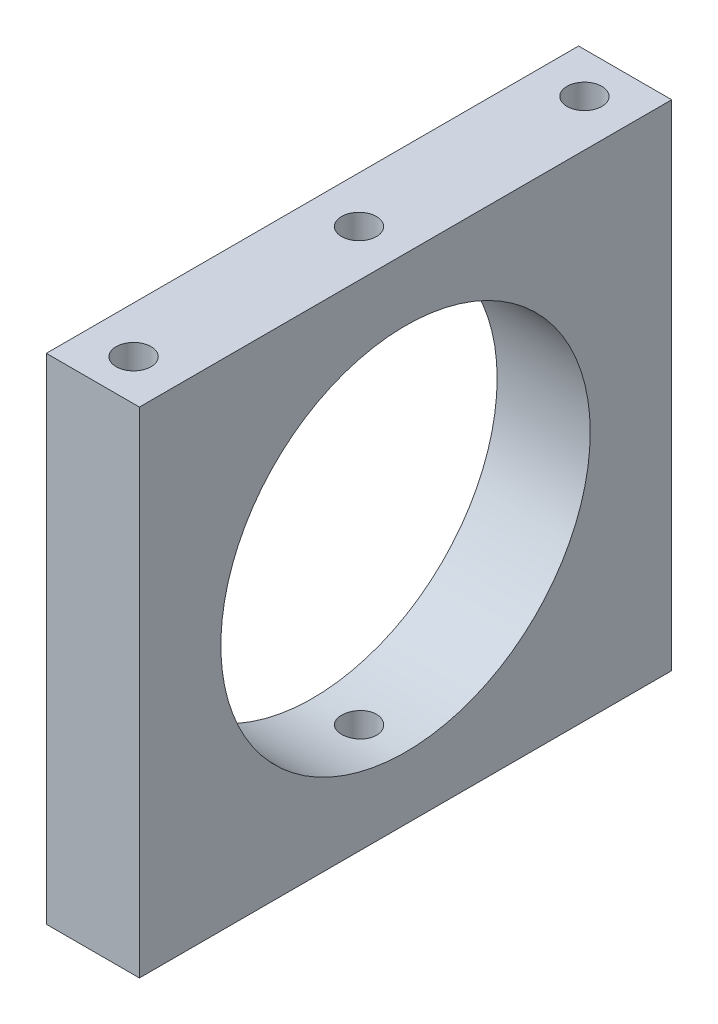
ISO-10303-21;
HEADER;
FILE_DESCRIPTION(('STEP AP214'),'2;1');
FILE_NAME('part.step','',(''),(''),'','','');
FILE_SCHEMA(('AUTOMOTIVE_DESIGN { 1 0 10303 214 1 1 1 1 }'));
ENDSEC;
DATA;
#1=APPLICATION_CONTEXT('core data for automotive mechanical design processes');
#2=APPLICATION_PROTOCOL_DEFINITION('international standard','automotive_design',2000,#1);
#3=PRODUCT_CONTEXT('',#1,'mechanical');
#4=PRODUCT('Part','Part','',(#3));
#5=PRODUCT_RELATED_PRODUCT_CATEGORY('part','',(#4));
#6=PRODUCT_DEFINITION_FORMATION('','',#4);
#7=PRODUCT_DEFINITION_CONTEXT('part definition',#1,'design');
#8=PRODUCT_DEFINITION('design','',#6,#7);
#9=PRODUCT_DEFINITION_SHAPE('','',#8);
#10=(LENGTH_UNIT() NAMED_UNIT(*) SI_UNIT(.MILLI.,.METRE.));
#11=(NAMED_UNIT(*) PLANE_ANGLE_UNIT() SI_UNIT($,.RADIAN.));
#12=(NAMED_UNIT(*) SI_UNIT($,.STERADIAN.) SOLID_ANGLE_UNIT());
#13=UNCERTAINTY_MEASURE_WITH_UNIT(LENGTH_MEASURE(1.E-05),#10,'distance_accuracy_value','');
#14=(GEOMETRIC_REPRESENTATION_CONTEXT(3) GLOBAL_UNCERTAINTY_ASSIGNED_CONTEXT((#13)) GLOBAL_UNIT_ASSIGNED_CONTEXT((#10,
#11,#12)) REPRESENTATION_CONTEXT('',''));
#15=CARTESIAN_POINT('',(0.,0.,0.));
#16=DIRECTION('',(0.,0.,1.));
#17=DIRECTION('',(1.,0.,0.));
#18=AXIS2_PLACEMENT_3D('',#15,#16,#17);
#19=CARTESIAN_POINT('',(0.,42.5,0.));
#20=DIRECTION('',(0.,-1.,0.));
#21=DIRECTION('',(0.,0.,-1.));
#22=AXIS2_PLACEMENT_3D('',#19,#20,#21);
#23=CYLINDRICAL_SURFACE('',#22,1.5);
#24=CARTESIAN_POINT('',(0.,37.0539749746701,-1.5));
#25=CARTESIAN_POINT('',(-0.0840536363328037,37.0539759091438,-1.49999634776618));
#26=CARTESIAN_POINT('',(-0.168163426862821,37.0546527591964,-1.49291120097191));
#27=CARTESIAN_POINT('',(-0.334052706700717,37.0572867743299,-1.46475324591116));
#28=CARTESIAN_POINT('',(-0.415829496781324,37.0592453642789,-1.44366487033248));
#29=CARTESIAN_POINT('',(-0.574626323247356,37.0642190684957,-1.38811853846567));
#30=CARTESIAN_POINT('',(-0.651649146485269,37.067233556725,-1.35366850296343));
#31=CARTESIAN_POINT('',(-0.798801947901103,37.0739786258328,-1.27239159203109));
#32=CARTESIAN_POINT('',(-0.868933327699084,37.0777090606404,-1.22556724053538));
#33=CARTESIAN_POINT('',(-1.00055842747435,37.0854793344331,-1.12070653593236));
#34=CARTESIAN_POINT('',(-1.06202653022181,37.0895200386241,-1.06263808817007));
#35=CARTESIAN_POINT('',(-1.17435979871408,37.097447689727,-0.93700592709332));
#36=CARTESIAN_POINT('',(-1.22522448709617,37.1013346297102,-0.869441786514596));
#37=CARTESIAN_POINT('',(-1.31499460002741,37.1085252402982,-0.726580460498479));
#38=CARTESIAN_POINT('',(-1.35387750641946,37.111827807755,-0.651269065022947));
#39=CARTESIAN_POINT('',(-1.41843626571398,37.1174681764433,-0.495149858781122));
#40=CARTESIAN_POINT('',(-1.44411240865282,37.1198059988614,-0.414342168764188));
#41=CARTESIAN_POINT('',(-1.48145407950935,37.1232474033305,-0.249781906954086));
#42=CARTESIAN_POINT('',(-1.49316149552488,37.1243546747531,-0.16603891869654));
#43=CARTESIAN_POINT('',(-1.50236294990409,37.1252227508324,0.00223019838057203));
#44=CARTESIAN_POINT('',(-1.49985732028504,37.1249835869419,0.0867563088603229));
#45=CARTESIAN_POINT('',(-1.48073790026304,37.1231887675992,0.253908044355716));
#46=CARTESIAN_POINT('',(-1.46416915264964,37.1216373153328,0.33653887295524));
#47=CARTESIAN_POINT('',(-1.41746394672628,37.11739715833,0.497841544232952));
#48=CARTESIAN_POINT('',(-1.38732732848963,37.1147084401883,0.576513340233232));
#49=CARTESIAN_POINT('',(-1.31429217669509,37.1084888760944,0.72780719825892));
#50=CARTESIAN_POINT('',(-1.27137362672072,37.1049567110424,0.800419541194211));
#51=CARTESIAN_POINT('',(-1.17400744487762,37.0974468033413,0.937427234183074));
#52=CARTESIAN_POINT('',(-1.11955951140564,37.093469049037,1.00182236920771));
#53=CARTESIAN_POINT('',(-1.00042662738608,37.0854962314334,1.12083136546873));
#54=CARTESIAN_POINT('',(-0.935702509043064,37.0815011612309,1.17540602526128));
#55=CARTESIAN_POINT('',(-0.797990578993203,37.0739595324643,1.27292162366473));
#56=CARTESIAN_POINT('',(-0.725002757303458,37.0704129744419,1.31586254822137));
#57=CARTESIAN_POINT('',(-0.572806062756796,37.0641694905722,1.3888910942952));
#58=CARTESIAN_POINT('',(-0.493596086531489,37.0614727158428,1.41897643002491));
#59=CARTESIAN_POINT('',(-0.331217833039493,37.0572372200977,1.46540946615925));
#60=CARTESIAN_POINT('',(-0.248049663258699,37.0556984676546,1.48175753937857));
#61=CARTESIAN_POINT('',(-0.0804596164003408,37.0539585730314,1.50020184306004));
#62=CARTESIAN_POINT('',(0.00395618051161047,37.0537522894256,1.50235285459515));
#63=CARTESIAN_POINT('',(0.171947065883922,37.0546871210395,1.49248571332648));
#64=CARTESIAN_POINT('',(0.255522164453875,37.0558282200371,1.48046773111406));
#65=CARTESIAN_POINT('',(0.419300430730805,37.0593245635284,1.44264952423754));
#66=CARTESIAN_POINT('',(0.499509604919228,37.061677536278,1.41687508377161));
#67=CARTESIAN_POINT('',(0.654465658964648,37.067330651119,1.35230188608052));
#68=CARTESIAN_POINT('',(0.72921242671256,37.0706308126434,1.31350286163338));
#69=CARTESIAN_POINT('',(0.871371922660361,37.077818915049,1.22384413984744));
#70=CARTESIAN_POINT('',(0.938761620636482,37.081708615485,1.17294806988556));
#71=CARTESIAN_POINT('',(1.06406076225195,37.0896317019391,1.06059228180143));
#72=CARTESIAN_POINT('',(1.12196999632234,37.0936650911311,0.999132330222436));
#73=CARTESIAN_POINT('',(1.2268526172345,37.1014365428754,0.867156072198296));
#74=CARTESIAN_POINT('',(1.27379031769242,37.1051736162774,0.796611339165302));
#75=CARTESIAN_POINT('',(1.35515216383036,37.1119170222681,0.648608861652388));
#76=CARTESIAN_POINT('',(1.38957646488746,37.1149233639299,0.57115120302415));
#77=CARTESIAN_POINT('',(1.44487357746314,37.1198620781876,0.411647340117423));
#78=CARTESIAN_POINT('',(1.46576812289318,37.1217961724963,0.329608726063212));
#79=CARTESIAN_POINT('',(1.49348357275269,37.1243795121223,0.163168507417491));
#80=CARTESIAN_POINT('',(1.50030482735093,37.1250287894083,0.0787669616729303));
#81=CARTESIAN_POINT('',(1.49967544175684,37.124969346211,-0.0896523179622793));
#82=CARTESIAN_POINT('',(1.49228027601232,37.1242659042229,-0.173670266555677));
#83=CARTESIAN_POINT('',(1.46354407268718,37.1215904802042,-0.339264836196759));
#84=CARTESIAN_POINT('',(1.44220302108887,37.1196184968984,-0.420841454790455));
#85=CARTESIAN_POINT('',(1.38619577956841,37.1146270396578,-0.579238654230514));
#86=CARTESIAN_POINT('',(1.35153100031499,37.1116076766191,-0.656059737576576));
#87=CARTESIAN_POINT('',(1.26986634095852,37.1048584573002,-0.802801454984796));
#88=CARTESIAN_POINT('',(1.22286657582933,37.1011286076424,-0.872722153356779));
#89=CARTESIAN_POINT('',(1.11765785168654,37.0933591562376,-1.00396255764163));
#90=CARTESIAN_POINT('',(1.05940764396942,37.0893184486117,-1.06524913148993));
#91=CARTESIAN_POINT('',(0.93343104545471,37.0813920904196,-1.17720353420051));
#92=CARTESIAN_POINT('',(0.865702376990453,37.0775064774119,-1.22786880344016));
#93=CARTESIAN_POINT('',(0.722523263489063,37.0703206308754,-1.31723224863173));
#94=CARTESIAN_POINT('',(0.647055382269658,37.0670217670734,-1.35590257564195));
#95=CARTESIAN_POINT('',(0.490715740360539,37.061399362306,-1.41997150275164));
#96=CARTESIAN_POINT('',(0.409850234627423,37.059074714375,-1.44538517398431));
#97=CARTESIAN_POINT('',(0.273766651124052,37.0562542769887,-1.4758344340282));
#98=CARTESIAN_POINT('',(0.219420484698648,37.0554035409091,-1.48488425599049));
#99=CARTESIAN_POINT('',(0.110057570231307,37.054263584812,-1.49696822381459));
#100=CARTESIAN_POINT('',(0.0550408246330296,37.0539743627489,-1.50000239159148));
#101=CARTESIAN_POINT('',(0.,37.0539749746701,-1.5));
#102=B_SPLINE_CURVE_WITH_KNOTS('',3,(#24,#25,#26,#27,#28,#29,#30,#31,#32,#33,#34,#35,#36,#37,
#38,#39,#40,#41,#42,#43,#44,#45,#46,#47,#48,#49,#50,#51,#52,#53,#54,#55,#56,#57,#58,#59,#60,#61,
#62,#63,#64,#65,#66,#67,#68,#69,#70,#71,#72,#73,#74,#75,#76,#77,#78,#79,#80,#81,#82,#83,#84,#85,
#86,#87,#88,#89,#90,#91,#92,#93,#94,#95,#96,#97,#98,#99,#100,#101),.UNSPECIFIED.,.T.,.F.,(4,2,2,
2,2,2,2,2,2,2,2,2,2,2,2,2,2,2,2,2,2,2,2,2,2,2,2,2,2,2,2,2,2,2,2,2,2,2,4),(0.,0.25195992212741,
0.50420041670237,0.756291611204931,1.0083314274155,1.26110155190283,1.5138830535734,
1.76713676698046,2.02038491839434,2.27287172910891,2.52535264174654,2.777027921131,
3.02870616713031,3.28078063067709,3.53286168918815,3.78592770285885,4.03899402224708,
4.29210531937791,4.54520974711535,4.79733696707451,5.04946115151211,5.30111442206551,
5.55277285603892,5.80519775211318,6.05762822737451,6.31086868325619,6.56410599457992,
6.81693549501914,7.06975870453033,7.32159736495547,7.57343627851654,7.82524853561388,
8.07705844566362,8.32980974749957,8.58262188989684,8.83601667322986,9.08912274756833,
9.25411421034408,9.41910507205359),.UNSPECIFIED.);
#103=CARTESIAN_POINT('',(0.,37.0539749746701,-1.5));
#104=VERTEX_POINT('',#103);
#105=EDGE_CURVE('E41',#104,#104,#102,.T.);
#106=ORIENTED_EDGE('',*,*,#105,.F.);
#107=EDGE_LOOP('',(#106));
#108=FACE_BOUND('',#107,.T.);
#109=CARTESIAN_POINT('',(0.,42.5,0.));
#110=DIRECTION('',(0.,1.,0.));
#111=DIRECTION('',(0.,0.,1.));
#112=AXIS2_PLACEMENT_3D('',#109,#110,#111);
#113=CIRCLE('',#112,1.5);
#114=CARTESIAN_POINT('',(0.,42.5,1.50000000000001));
#115=VERTEX_POINT('',#114);
#116=EDGE_CURVE('E113',#115,#115,#113,.T.);
#117=ORIENTED_EDGE('',*,*,#116,.T.);
#118=EDGE_LOOP('',(#117));
#119=FACE_BOUND('',#118,.T.);
#120=ADVANCED_FACE('F37',(#108,#119),#23,.F.);
#121=CARTESIAN_POINT('',(0.,42.5,0.));
#122=DIRECTION('',(0.,-1.,0.));
#123=DIRECTION('',(0.,0.,-1.));
#124=AXIS2_PLACEMENT_3D('',#121,#122,#123);
#125=PLANE('',#124);
#126=DIRECTION('',(0.,0.,-1.));
#127=VECTOR('',#126,1.);
#128=CARTESIAN_POINT('',(4.0005,42.5,22.875));
#129=LINE('',#128,#127);
#130=CARTESIAN_POINT('',(4.0005,42.5,22.875));
#131=VERTEX_POINT('',#130);
#132=CARTESIAN_POINT('',(4.0005,42.5,-22.875));
#133=VERTEX_POINT('',#132);
#134=EDGE_CURVE('E97',#131,#133,#129,.T.);
#135=ORIENTED_EDGE('',*,*,#134,.T.);
#136=DIRECTION('',(-1.,0.,0.));
#137=VECTOR('',#136,1.);
#138=CARTESIAN_POINT('',(-4.0005,42.5,-22.875));
#139=LINE('',#138,#137);
#140=CARTESIAN_POINT('',(-4.0005,42.5,-22.875));
#141=VERTEX_POINT('',#140);
#142=EDGE_CURVE('E91',#133,#141,#139,.T.);
#143=ORIENTED_EDGE('',*,*,#142,.T.);
#144=DIRECTION('',(0.,0.,1.));
#145=VECTOR('',#144,1.);
#146=CARTESIAN_POINT('',(-4.0005,42.5,22.875));
#147=LINE('',#146,#145);
#148=CARTESIAN_POINT('',(-4.0005,42.5,22.875));
#149=VERTEX_POINT('',#148);
#150=EDGE_CURVE('E95',#141,#149,#147,.T.);
#151=ORIENTED_EDGE('',*,*,#150,.T.);
#152=DIRECTION('',(1.,0.,0.));
#153=VECTOR('',#152,1.);
#154=CARTESIAN_POINT('',(-4.0005,42.5,22.875));
#155=LINE('',#154,#153);
#156=EDGE_CURVE('E61',#149,#131,#155,.T.);
#157=ORIENTED_EDGE('',*,*,#156,.T.);
#158=EDGE_LOOP('',(#135,#143,#151,#157));
#159=FACE_BOUND('',#158,.T.);
#160=ORIENTED_EDGE('',*,*,#116,.F.);
#161=EDGE_LOOP('',(#160));
#162=FACE_BOUND('',#161,.T.);
#163=CARTESIAN_POINT('',(0.,42.5,-19.375));
#164=DIRECTION('',(0.,1.,0.));
#165=DIRECTION('',(0.,0.,1.));
#166=AXIS2_PLACEMENT_3D('',#163,#164,#165);
#167=CIRCLE('',#166,1.5);
#168=CARTESIAN_POINT('',(0.,42.5,-17.875));
#169=VERTEX_POINT('',#168);
#170=EDGE_CURVE('E161',#169,#169,#167,.T.);
#171=ORIENTED_EDGE('',*,*,#170,.F.);
#172=EDGE_LOOP('',(#171));
#173=FACE_BOUND('',#172,.T.);
#174=CARTESIAN_POINT('',(0.,42.5,19.375));
#175=DIRECTION('',(0.,1.,0.));
#176=DIRECTION('',(0.,0.,1.));
#177=AXIS2_PLACEMENT_3D('',#174,#175,#176);
#178=CIRCLE('',#177,1.5);
#179=CARTESIAN_POINT('',(0.,42.5,20.875));
#180=VERTEX_POINT('',#179);
#181=EDGE_CURVE('E167',#180,#180,#178,.T.);
#182=ORIENTED_EDGE('',*,*,#181,.F.);
#183=EDGE_LOOP('',(#182));
#184=FACE_BOUND('',#183,.T.);
#185=ADVANCED_FACE('F92',(#159,#162,#173,#184),#125,.F.);
#186=CARTESIAN_POINT('',(0.,0.,0.));
#187=DIRECTION('',(0.,-1.,0.));
#188=DIRECTION('',(0.,0.,-1.));
#189=AXIS2_PLACEMENT_3D('',#186,#187,#188);
#190=PLANE('',#189);
#191=CARTESIAN_POINT('',(0.,0.,-19.375));
#192=DIRECTION('',(0.,1.,0.));
#193=DIRECTION('',(0.,0.,1.));
#194=AXIS2_PLACEMENT_3D('',#191,#192,#193);
#195=CIRCLE('',#194,1.5);
#196=CARTESIAN_POINT('',(0.,0.,-17.875));
#197=VERTEX_POINT('',#196);
#198=EDGE_CURVE('E164',#197,#197,#195,.T.);
#199=ORIENTED_EDGE('',*,*,#198,.T.);
#200=EDGE_LOOP('',(#199));
#201=FACE_BOUND('',#200,.T.);
#202=DIRECTION('',(0.,0.,-1.));
#203=VECTOR('',#202,1.);
#204=CARTESIAN_POINT('',(4.0005,0.,22.875));
#205=LINE('',#204,#203);
#206=CARTESIAN_POINT('',(4.0005,0.,22.875));
#207=VERTEX_POINT('',#206);
#208=CARTESIAN_POINT('',(4.0005,0.,-22.875));
#209=VERTEX_POINT('',#208);
#210=EDGE_CURVE('E110',#207,#209,#205,.T.);
#211=ORIENTED_EDGE('',*,*,#210,.F.);
#212=DIRECTION('',(1.,0.,0.));
#213=VECTOR('',#212,1.);
#214=CARTESIAN_POINT('',(-4.0005,0.,22.875));
#215=LINE('',#214,#213);
#216=CARTESIAN_POINT('',(-4.0005,0.,22.875));
#217=VERTEX_POINT('',#216);
#218=EDGE_CURVE('E84',#217,#207,#215,.T.);
#219=ORIENTED_EDGE('',*,*,#218,.F.);
#220=DIRECTION('',(0.,0.,1.));
#221=VECTOR('',#220,1.);
#222=CARTESIAN_POINT('',(-4.0005,0.,22.875));
#223=LINE('',#222,#221);
#224=CARTESIAN_POINT('',(-4.0005,0.,-22.875));
#225=VERTEX_POINT('',#224);
#226=EDGE_CURVE('E78',#225,#217,#223,.T.);
#227=ORIENTED_EDGE('',*,*,#226,.F.);
#228=DIRECTION('',(-1.,0.,0.));
#229=VECTOR('',#228,1.);
#230=CARTESIAN_POINT('',(-4.0005,0.,-22.875));
#231=LINE('',#230,#229);
#232=EDGE_CURVE('E101',#209,#225,#231,.T.);
#233=ORIENTED_EDGE('',*,*,#232,.F.);
#234=EDGE_LOOP('',(#211,#219,#227,#233));
#235=FACE_BOUND('',#234,.T.);
#236=CARTESIAN_POINT('',(0.,0.,0.));
#237=DIRECTION('',(0.,1.,0.));
#238=DIRECTION('',(0.,0.,1.));
#239=AXIS2_PLACEMENT_3D('',#236,#237,#238);
#240=CIRCLE('',#239,1.5);
#241=CARTESIAN_POINT('',(0.,0.,1.50000000000001));
#242=VERTEX_POINT('',#241);
#243=EDGE_CURVE('E158',#242,#242,#240,.T.);
#244=ORIENTED_EDGE('',*,*,#243,.T.);
#245=EDGE_LOOP('',(#244));
#246=FACE_BOUND('',#245,.T.);
#247=CARTESIAN_POINT('',(0.,0.,19.375));
#248=DIRECTION('',(0.,1.,0.));
#249=DIRECTION('',(0.,0.,1.));
#250=AXIS2_PLACEMENT_3D('',#247,#248,#249);
#251=CIRCLE('',#250,1.5);
#252=CARTESIAN_POINT('',(0.,0.,20.875));
#253=VERTEX_POINT('',#252);
#254=EDGE_CURVE('E169',#253,#253,#251,.T.);
#255=ORIENTED_EDGE('',*,*,#254,.T.);
#256=EDGE_LOOP('',(#255));
#257=FACE_BOUND('',#256,.T.);
#258=ADVANCED_FACE('F152',(#201,#235,#246,#257),#190,.T.);
#259=CARTESIAN_POINT('',(4.0005,42.5,22.875));
#260=DIRECTION('',(-1.,0.,0.));
#261=DIRECTION('',(0.,0.,1.));
#262=AXIS2_PLACEMENT_3D('',#259,#260,#261);
#263=PLANE('',#262);
#264=CARTESIAN_POINT('',(4.0005,21.25,0.));
#265=DIRECTION('',(1.,0.,0.));
#266=DIRECTION('',(0.,0.,-1.));
#267=AXIS2_PLACEMENT_3D('',#264,#265,#266);
#268=CIRCLE('',#267,15.875);
#269=CARTESIAN_POINT('',(4.0005,21.25,-15.875));
#270=VERTEX_POINT('',#269);
#271=EDGE_CURVE('E123',#270,#270,#268,.T.);
#272=ORIENTED_EDGE('',*,*,#271,.F.);
#273=EDGE_LOOP('',(#272));
#274=FACE_BOUND('',#273,.T.);
#275=ORIENTED_EDGE('',*,*,#210,.T.);
#276=DIRECTION('',(0.,-1.,0.));
#277=VECTOR('',#276,1.);
#278=CARTESIAN_POINT('',(4.0005,42.5,-22.875));
#279=LINE('',#278,#277);
#280=EDGE_CURVE('E11',#133,#209,#279,.T.);
#281=ORIENTED_EDGE('',*,*,#280,.F.);
#282=ORIENTED_EDGE('',*,*,#134,.F.);
#283=DIRECTION('',(0.,-1.,0.));
#284=VECTOR('',#283,1.);
#285=CARTESIAN_POINT('',(4.0005,42.5,22.875));
#286=LINE('',#285,#284);
#287=EDGE_CURVE('E106',#131,#207,#286,.T.);
#288=ORIENTED_EDGE('',*,*,#287,.T.);
#289=EDGE_LOOP('',(#275,#281,#282,#288));
#290=FACE_BOUND('',#289,.T.);
#291=ADVANCED_FACE('F39',(#274,#290),#263,.F.);
#292=CARTESIAN_POINT('',(-4.0005,42.5,-22.875));
#293=DIRECTION('',(0.,0.,1.));
#294=DIRECTION('',(1.,0.,0.));
#295=AXIS2_PLACEMENT_3D('',#292,#293,#294);
#296=PLANE('',#295);
#297=ORIENTED_EDGE('',*,*,#232,.T.);
#298=DIRECTION('',(0.,-1.,0.));
#299=VECTOR('',#298,1.);
#300=CARTESIAN_POINT('',(-4.0005,42.5,-22.875));
#301=LINE('',#300,#299);
#302=EDGE_CURVE('E52',#141,#225,#301,.T.);
#303=ORIENTED_EDGE('',*,*,#302,.F.);
#304=ORIENTED_EDGE('',*,*,#142,.F.);
#305=ORIENTED_EDGE('',*,*,#280,.T.);
#306=EDGE_LOOP('',(#297,#303,#304,#305));
#307=FACE_BOUND('',#306,.T.);
#308=ADVANCED_FACE('F100',(#307),#296,.F.);
#309=CARTESIAN_POINT('',(-4.0005,42.5,22.875));
#310=DIRECTION('',(1.,0.,0.));
#311=DIRECTION('',(0.,0.,-1.));
#312=AXIS2_PLACEMENT_3D('',#309,#310,#311);
#313=PLANE('',#312);
#314=CARTESIAN_POINT('',(-4.0005,21.25,0.));
#315=DIRECTION('',(1.,0.,0.));
#316=DIRECTION('',(0.,0.,-1.));
#317=AXIS2_PLACEMENT_3D('',#314,#315,#316);
#318=CIRCLE('',#317,15.875);
#319=CARTESIAN_POINT('',(-4.0005,21.25,-15.875));
#320=VERTEX_POINT('',#319);
#321=EDGE_CURVE('E172',#320,#320,#318,.T.);
#322=ORIENTED_EDGE('',*,*,#321,.T.);
#323=EDGE_LOOP('',(#322));
#324=FACE_BOUND('',#323,.T.);
#325=ORIENTED_EDGE('',*,*,#226,.T.);
#326=DIRECTION('',(0.,-1.,0.));
#327=VECTOR('',#326,1.);
#328=CARTESIAN_POINT('',(-4.0005,42.5,22.875));
#329=LINE('',#328,#327);
#330=EDGE_CURVE('E102',#149,#217,#329,.T.);
#331=ORIENTED_EDGE('',*,*,#330,.F.);
#332=ORIENTED_EDGE('',*,*,#150,.F.);
#333=ORIENTED_EDGE('',*,*,#302,.T.);
#334=EDGE_LOOP('',(#325,#331,#332,#333));
#335=FACE_BOUND('',#334,.T.);
#336=ADVANCED_FACE('F104',(#324,#335),#313,.F.);
#337=CARTESIAN_POINT('',(-4.0005,42.5,22.875));
#338=DIRECTION('',(0.,0.,-1.));
#339=DIRECTION('',(-1.,0.,0.));
#340=AXIS2_PLACEMENT_3D('',#337,#338,#339);
#341=PLANE('',#340);
#342=ORIENTED_EDGE('',*,*,#218,.T.);
#343=ORIENTED_EDGE('',*,*,#287,.F.);
#344=ORIENTED_EDGE('',*,*,#156,.F.);
#345=ORIENTED_EDGE('',*,*,#330,.T.);
#346=EDGE_LOOP('',(#342,#343,#344,#345));
#347=FACE_BOUND('',#346,.T.);
#348=ADVANCED_FACE('F143',(#347),#341,.F.);
#349=CARTESIAN_POINT('',(0.,5.44602502532986,-1.5));
#350=CARTESIAN_POINT('',(0.084053636332802,5.44602409085617,-1.49999634776618));
#351=CARTESIAN_POINT('',(0.16816342686282,5.44534724080361,-1.49291120097191));
#352=CARTESIAN_POINT('',(0.334052706700716,5.4427132256701,-1.46475324591116));
#353=CARTESIAN_POINT('',(0.415829496781322,5.44075463572106,-1.44366487033248));
#354=CARTESIAN_POINT('',(0.574626323247354,5.4357809315043,-1.38811853846567));
#355=CARTESIAN_POINT('',(0.651649146485268,5.43276644327498,-1.35366850296343));
#356=CARTESIAN_POINT('',(0.798801947901102,5.4260213741672,-1.27239159203109));
#357=CARTESIAN_POINT('',(0.868933327699082,5.42229093935962,-1.22556724053538));
#358=CARTESIAN_POINT('',(1.00055842747435,5.41452066556692,-1.12070653593236));
#359=CARTESIAN_POINT('',(1.0620265302218,5.41047996137593,-1.06263808817007));
#360=CARTESIAN_POINT('',(1.17435979871408,5.40255231027297,-0.93700592709332));
#361=CARTESIAN_POINT('',(1.22522448709617,5.39866537028981,-0.869441786514595));
#362=CARTESIAN_POINT('',(1.3149946000274,5.39147475970182,-0.726580460498478));
#363=CARTESIAN_POINT('',(1.35387750641946,5.38817219224496,-0.651269065022947));
#364=CARTESIAN_POINT('',(1.41843626571398,5.3825318235567,-0.495149858781121));
#365=CARTESIAN_POINT('',(1.44411240865282,5.38019400113856,-0.414342168764188));
#366=CARTESIAN_POINT('',(1.48145407950935,5.37675259666951,-0.249781906954086));
#367=CARTESIAN_POINT('',(1.49316149552488,5.37564532524688,-0.16603891869654));
#368=CARTESIAN_POINT('',(1.50236294990409,5.37477724916759,0.00223019838057196));
#369=CARTESIAN_POINT('',(1.49985732028504,5.37501641305815,0.0867563088603228));
#370=CARTESIAN_POINT('',(1.48073790026304,5.37681123240084,0.253908044355716));
#371=CARTESIAN_POINT('',(1.46416915264964,5.37836268466715,0.336538872955239));
#372=CARTESIAN_POINT('',(1.41746394672627,5.38260284167001,0.497841544232952));
#373=CARTESIAN_POINT('',(1.38732732848963,5.38529155981167,0.576513340233232));
#374=CARTESIAN_POINT('',(1.31429217669509,5.39151112390562,0.72780719825892));
#375=CARTESIAN_POINT('',(1.27137362672072,5.39504328895756,0.800419541194211));
#376=CARTESIAN_POINT('',(1.17400744487762,5.40255319665869,0.937427234183074));
#377=CARTESIAN_POINT('',(1.11955951140564,5.40653095096301,1.00182236920771));
#378=CARTESIAN_POINT('',(1.00042662738608,5.41450376856662,1.12083136546873));
#379=CARTESIAN_POINT('',(0.935702509043062,5.41849883876906,1.17540602526128));
#380=CARTESIAN_POINT('',(0.797990578993201,5.4260404675357,1.27292162366473));
#381=CARTESIAN_POINT('',(0.725002757303456,5.42958702555807,1.31586254822137));
#382=CARTESIAN_POINT('',(0.572806062756794,5.43583050942782,1.3888910942952));
#383=CARTESIAN_POINT('',(0.493596086531488,5.43852728415716,1.41897643002491));
#384=CARTESIAN_POINT('',(0.331217833039491,5.44276277990226,1.46540946615925));
#385=CARTESIAN_POINT('',(0.248049663258697,5.4443015323454,1.48175753937857));
#386=CARTESIAN_POINT('',(0.0804596164003387,5.44604142696863,1.50020184306004));
#387=CARTESIAN_POINT('',(-0.00395618051161248,5.44624771057442,1.50235285459515));
#388=CARTESIAN_POINT('',(-0.171947065883924,5.44531287896048,1.49248571332648));
#389=CARTESIAN_POINT('',(-0.255522164453877,5.44417177996291,1.48046773111406));
#390=CARTESIAN_POINT('',(-0.419300430730807,5.44067543647158,1.44264952423754));
#391=CARTESIAN_POINT('',(-0.49950960491923,5.43832246372198,1.41687508377161));
#392=CARTESIAN_POINT('',(-0.65446565896465,5.43266934888099,1.35230188608052));
#393=CARTESIAN_POINT('',(-0.729212426712563,5.42936918735658,1.31350286163338));
#394=CARTESIAN_POINT('',(-0.871371922660363,5.42218108495098,1.22384413984744));
#395=CARTESIAN_POINT('',(-0.938761620636483,5.418291384515,1.17294806988556));
#396=CARTESIAN_POINT('',(-1.06406076225195,5.41036829806089,1.06059228180143));
#397=CARTESIAN_POINT('',(-1.12196999632234,5.40633490886887,0.999132330222436));
#398=CARTESIAN_POINT('',(-1.2268526172345,5.39856345712459,0.867156072198295));
#399=CARTESIAN_POINT('',(-1.27379031769242,5.39482638372255,0.796611339165302));
#400=CARTESIAN_POINT('',(-1.35515216383036,5.38808297773195,0.648608861652388));
#401=CARTESIAN_POINT('',(-1.38957646488746,5.38507663607015,0.57115120302415));
#402=CARTESIAN_POINT('',(-1.44487357746314,5.38013792181241,0.411647340117422));
#403=CARTESIAN_POINT('',(-1.46576812289318,5.37820382750374,0.329608726063211));
#404=CARTESIAN_POINT('',(-1.49348357275269,5.37562048787766,0.16316850741749));
#405=CARTESIAN_POINT('',(-1.50030482735093,5.37497121059171,0.0787669616729298));
#406=CARTESIAN_POINT('',(-1.49967544175684,5.37503065378902,-0.08965231796228));
#407=CARTESIAN_POINT('',(-1.49228027601232,5.37573409577707,-0.173670266555678));
#408=CARTESIAN_POINT('',(-1.46354407268719,5.37840951979583,-0.33926483619676));
#409=CARTESIAN_POINT('',(-1.44220302108887,5.38038150310161,-0.420841454790455));
#410=CARTESIAN_POINT('',(-1.38619577956841,5.38537296034219,-0.579238654230514));
#411=CARTESIAN_POINT('',(-1.35153100031499,5.38839232338087,-0.656059737576577));
#412=CARTESIAN_POINT('',(-1.26986634095852,5.39514154269981,-0.802801454984797));
#413=CARTESIAN_POINT('',(-1.22286657582933,5.39887139235758,-0.87272215335678));
#414=CARTESIAN_POINT('',(-1.11765785168654,5.40664084376241,-1.00396255764163));
#415=CARTESIAN_POINT('',(-1.05940764396942,5.41068155138834,-1.06524913148993));
#416=CARTESIAN_POINT('',(-0.93343104545471,5.41860790958037,-1.17720353420051));
#417=CARTESIAN_POINT('',(-0.865702376990454,5.42249352258805,-1.22786880344016));
#418=CARTESIAN_POINT('',(-0.722523263489064,5.42967936912456,-1.31723224863173));
#419=CARTESIAN_POINT('',(-0.647055382269659,5.4329782329266,-1.35590257564195));
#420=CARTESIAN_POINT('',(-0.49071574036054,5.43860063769396,-1.41997150275164));
#421=CARTESIAN_POINT('',(-0.409850234627424,5.44092528562496,-1.44538517398431));
#422=CARTESIAN_POINT('',(-0.273766651124054,5.44374572301129,-1.4758344340282));
#423=CARTESIAN_POINT('',(-0.219420484698651,5.44459645909089,-1.48488425599049));
#424=CARTESIAN_POINT('',(-0.11005757023131,5.44573641518798,-1.49696822381459));
#425=CARTESIAN_POINT('',(-0.0550408246330318,5.44602563725107,-1.50000239159148));
#426=CARTESIAN_POINT('',(0.,5.44602502532986,-1.5));
#427=B_SPLINE_CURVE_WITH_KNOTS('',3,(#349,#350,#351,#352,#353,#354,#355,#356,#357,#358,#359,
#360,#361,#362,#363,#364,#365,#366,#367,#368,#369,#370,#371,#372,#373,#374,#375,#376,#377,#378,
#379,#380,#381,#382,#383,#384,#385,#386,#387,#388,#389,#390,#391,#392,#393,#394,#395,#396,#397,
#398,#399,#400,#401,#402,#403,#404,#405,#406,#407,#408,#409,#410,#411,#412,#413,#414,#415,#416,
#417,#418,#419,#420,#421,#422,#423,#424,#425,#426),.UNSPECIFIED.,.T.,.F.,(4,2,2,2,2,2,2,2,2,2,2,
2,2,2,2,2,2,2,2,2,2,2,2,2,2,2,2,2,2,2,2,2,2,2,2,2,2,2,4),(0.,0.25195992212741,0.50420041670237,
0.756291611204932,1.0083314274155,1.26110155190283,1.5138830535734,1.76713676698046,
2.02038491839434,2.27287172910891,2.52535264174654,2.777027921131,3.02870616713031,
3.28078063067709,3.53286168918815,3.78592770285885,4.03899402224708,4.29210531937791,
4.54520974711535,4.79733696707451,5.04946115151211,5.30111442206551,5.55277285603892,
5.80519775211318,6.05762822737451,6.31086868325619,6.56410599457992,6.81693549501914,
7.06975870453033,7.32159736495547,7.57343627851655,7.82524853561388,8.07705844566362,
8.32980974749957,8.58262188989684,8.83601667322987,9.08912274756833,9.25411421034408,
9.4191050720536),.UNSPECIFIED.);
#428=CARTESIAN_POINT('',(0.,5.44602502532986,-1.5));
#429=VERTEX_POINT('',#428);
#430=EDGE_CURVE('E118',#429,#429,#427,.T.);
#431=ORIENTED_EDGE('',*,*,#430,.F.);
#432=EDGE_LOOP('',(#431));
#433=FACE_BOUND('',#432,.T.);
#434=ORIENTED_EDGE('',*,*,#243,.F.);
#435=EDGE_LOOP('',(#434));
#436=FACE_BOUND('',#435,.T.);
#437=ADVANCED_FACE('F124',(#433,#436),#23,.F.);
#438=CARTESIAN_POINT('',(0.,42.5,-19.375));
#439=DIRECTION('',(0.,-1.,0.));
#440=DIRECTION('',(0.,0.,-1.));
#441=AXIS2_PLACEMENT_3D('',#438,#439,#440);
#442=CYLINDRICAL_SURFACE('',#441,1.5);
#443=ORIENTED_EDGE('',*,*,#170,.T.);
#444=EDGE_LOOP('',(#443));
#445=FACE_BOUND('',#444,.T.);
#446=ORIENTED_EDGE('',*,*,#198,.F.);
#447=EDGE_LOOP('',(#446));
#448=FACE_BOUND('',#447,.T.);
#449=ADVANCED_FACE('F136',(#445,#448),#442,.F.);
#450=CARTESIAN_POINT('',(0.,42.5,19.375));
#451=DIRECTION('',(0.,-1.,0.));
#452=DIRECTION('',(0.,0.,-1.));
#453=AXIS2_PLACEMENT_3D('',#450,#451,#452);
#454=CYLINDRICAL_SURFACE('',#453,1.5);
#455=ORIENTED_EDGE('',*,*,#181,.T.);
#456=EDGE_LOOP('',(#455));
#457=FACE_BOUND('',#456,.T.);
#458=ORIENTED_EDGE('',*,*,#254,.F.);
#459=EDGE_LOOP('',(#458));
#460=FACE_BOUND('',#459,.T.);
#461=ADVANCED_FACE('F132',(#457,#460),#454,.F.);
#462=CARTESIAN_POINT('',(-38.4995,21.25,0.));
#463=DIRECTION('',(1.,0.,0.));
#464=DIRECTION('',(0.,0.,-1.));
#465=AXIS2_PLACEMENT_3D('',#462,#463,#464);
#466=CYLINDRICAL_SURFACE('',#465,15.875);
#467=ORIENTED_EDGE('',*,*,#271,.T.);
#468=EDGE_LOOP('',(#467));
#469=FACE_BOUND('',#468,.T.);
#470=ORIENTED_EDGE('',*,*,#430,.T.);
#471=EDGE_LOOP('',(#470));
#472=FACE_BOUND('',#471,.T.);
#473=ORIENTED_EDGE('',*,*,#105,.T.);
#474=EDGE_LOOP('',(#473));
#475=FACE_BOUND('',#474,.T.);
#476=ORIENTED_EDGE('',*,*,#321,.F.);
#477=EDGE_LOOP('',(#476));
#478=FACE_BOUND('',#477,.T.);
#479=ADVANCED_FACE('F128',(#469,#472,#475,#478),#466,.F.);
#480=CLOSED_SHELL('',(#120,#185,#258,#291,#308,#336,#348,#437,#449,#461,#479));
#481=MANIFOLD_SOLID_BREP('B2',#480);
#482=ADVANCED_BREP_SHAPE_REPRESENTATION('',(#18,#481),#14);
#483=SHAPE_DEFINITION_REPRESENTATION(#9,#482);
ENDSEC;
END-ISO-10303-21;
